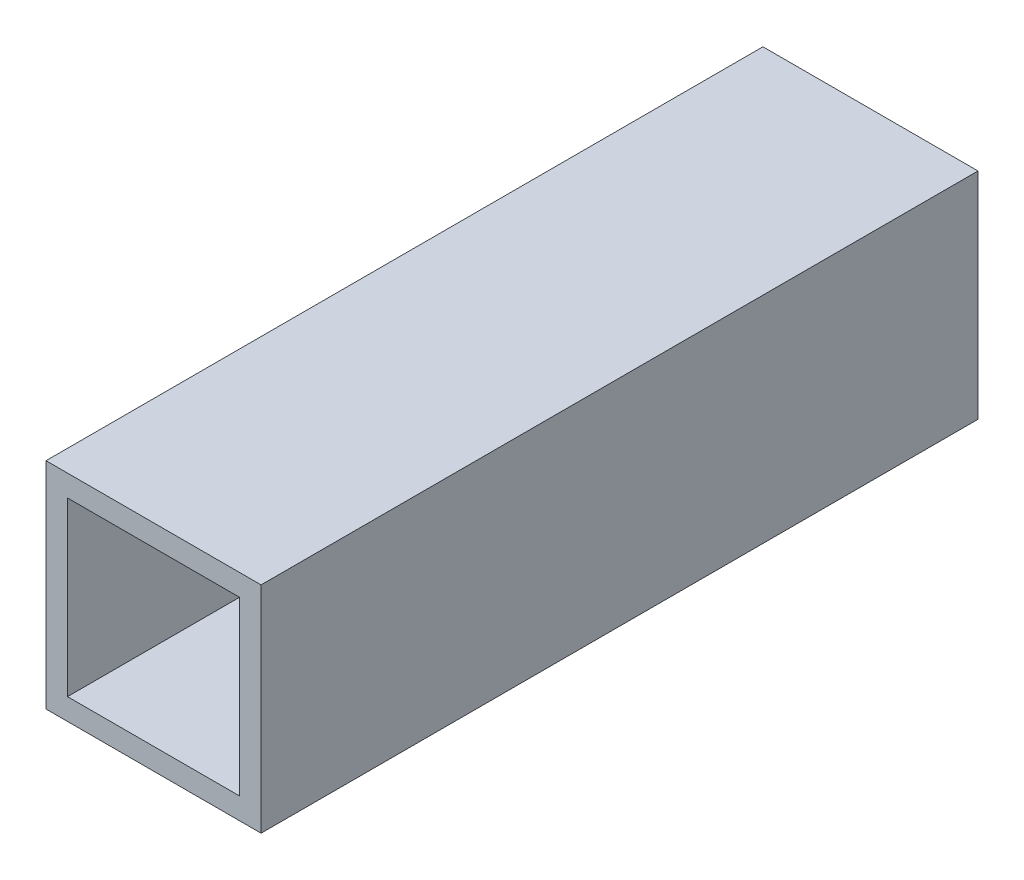
ISO-10303-21;
HEADER;
FILE_DESCRIPTION(('STEP AP214'),'2;1');
FILE_NAME('part.step','',(''),(''),'','','');
FILE_SCHEMA(('AUTOMOTIVE_DESIGN { 1 0 10303 214 1 1 1 1 }'));
ENDSEC;
DATA;
#1=APPLICATION_CONTEXT('core data for automotive mechanical design processes');
#2=APPLICATION_PROTOCOL_DEFINITION('international standard','automotive_design',2000,#1);
#3=PRODUCT_CONTEXT('',#1,'mechanical');
#4=PRODUCT('Part','Part','',(#3));
#5=PRODUCT_RELATED_PRODUCT_CATEGORY('part','',(#4));
#6=PRODUCT_DEFINITION_FORMATION('','',#4);
#7=PRODUCT_DEFINITION_CONTEXT('part definition',#1,'design');
#8=PRODUCT_DEFINITION('design','',#6,#7);
#9=PRODUCT_DEFINITION_SHAPE('','',#8);
#10=(LENGTH_UNIT() NAMED_UNIT(*) SI_UNIT(.MILLI.,.METRE.));
#11=(NAMED_UNIT(*) PLANE_ANGLE_UNIT() SI_UNIT($,.RADIAN.));
#12=(NAMED_UNIT(*) SI_UNIT($,.STERADIAN.) SOLID_ANGLE_UNIT());
#13=UNCERTAINTY_MEASURE_WITH_UNIT(LENGTH_MEASURE(1.E-05),#10,'distance_accuracy_value','');
#14=(GEOMETRIC_REPRESENTATION_CONTEXT(3) GLOBAL_UNCERTAINTY_ASSIGNED_CONTEXT((#13)) GLOBAL_UNIT_ASSIGNED_CONTEXT((#10,
#11,#12)) REPRESENTATION_CONTEXT('',''));
#15=CARTESIAN_POINT('',(0.,0.,0.));
#16=DIRECTION('',(0.,0.,1.));
#17=DIRECTION('',(1.,0.,0.));
#18=AXIS2_PLACEMENT_3D('',#15,#16,#17);
#19=CARTESIAN_POINT('',(0.,0.,50.));
#20=DIRECTION('',(0.,0.,1.));
#21=DIRECTION('',(1.,0.,0.));
#22=AXIS2_PLACEMENT_3D('',#19,#20,#21);
#23=PLANE('',#22);
#24=DIRECTION('',(0.,-1.,0.));
#25=VECTOR('',#24,1.);
#26=CARTESIAN_POINT('',(-7.01008414074451,7.73262608579252,50.));
#27=LINE('',#26,#25);
#28=CARTESIAN_POINT('',(-7.01008414074451,7.73262608579252,50.));
#29=VERTEX_POINT('',#28);
#30=CARTESIAN_POINT('',(-7.01008414074451,-7.26737391420748,50.));
#31=VERTEX_POINT('',#30);
#32=EDGE_CURVE('E133',#29,#31,#27,.T.);
#33=ORIENTED_EDGE('',*,*,#32,.T.);
#34=DIRECTION('',(1.,0.,0.));
#35=VECTOR('',#34,1.);
#36=CARTESIAN_POINT('',(-7.01008414074451,-7.26737391420748,50.));
#37=LINE('',#36,#35);
#38=CARTESIAN_POINT('',(7.98991585925548,-7.26737391420748,50.));
#39=VERTEX_POINT('',#38);
#40=EDGE_CURVE('E136',#31,#39,#37,.T.);
#41=ORIENTED_EDGE('',*,*,#40,.T.);
#42=DIRECTION('',(0.,1.,0.));
#43=VECTOR('',#42,1.);
#44=CARTESIAN_POINT('',(7.98991585925549,7.73262608579252,50.));
#45=LINE('',#44,#43);
#46=CARTESIAN_POINT('',(7.98991585925549,7.73262608579252,50.));
#47=VERTEX_POINT('',#46);
#48=EDGE_CURVE('E139',#39,#47,#45,.T.);
#49=ORIENTED_EDGE('',*,*,#48,.T.);
#50=DIRECTION('',(-1.,0.,0.));
#51=VECTOR('',#50,1.);
#52=CARTESIAN_POINT('',(-7.01008414074451,7.73262608579252,50.));
#53=LINE('',#52,#51);
#54=EDGE_CURVE('E141',#47,#29,#53,.T.);
#55=ORIENTED_EDGE('',*,*,#54,.T.);
#56=EDGE_LOOP('',(#33,#41,#49,#55));
#57=FACE_BOUND('',#56,.T.);
#58=DIRECTION('',(1.,0.,0.));
#59=VECTOR('',#58,1.);
#60=CARTESIAN_POINT('',(-5.51008414074451,-5.76737391420748,50.));
#61=LINE('',#60,#59);
#62=CARTESIAN_POINT('',(-5.51008414074451,-5.76737391420748,50.));
#63=VERTEX_POINT('',#62);
#64=CARTESIAN_POINT('',(6.48991585925549,-5.76737391420748,50.));
#65=VERTEX_POINT('',#64);
#66=EDGE_CURVE('E105',#63,#65,#61,.T.);
#67=ORIENTED_EDGE('',*,*,#66,.F.);
#68=DIRECTION('',(0.,-1.,0.));
#69=VECTOR('',#68,1.);
#70=CARTESIAN_POINT('',(-5.51008414074451,6.23262608579252,50.));
#71=LINE('',#70,#69);
#72=CARTESIAN_POINT('',(-5.51008414074451,6.23262608579252,50.));
#73=VERTEX_POINT('',#72);
#74=EDGE_CURVE('E97',#73,#63,#71,.T.);
#75=ORIENTED_EDGE('',*,*,#74,.F.);
#76=DIRECTION('',(-1.,0.,0.));
#77=VECTOR('',#76,1.);
#78=CARTESIAN_POINT('',(-5.51008414074451,6.23262608579252,50.));
#79=LINE('',#78,#77);
#80=CARTESIAN_POINT('',(6.48991585925549,6.23262608579252,50.));
#81=VERTEX_POINT('',#80);
#82=EDGE_CURVE('E119',#81,#73,#79,.T.);
#83=ORIENTED_EDGE('',*,*,#82,.F.);
#84=DIRECTION('',(0.,1.,0.));
#85=VECTOR('',#84,1.);
#86=CARTESIAN_POINT('',(6.48991585925549,6.23262608579252,50.));
#87=LINE('',#86,#85);
#88=EDGE_CURVE('E117',#65,#81,#87,.T.);
#89=ORIENTED_EDGE('',*,*,#88,.F.);
#90=EDGE_LOOP('',(#67,#75,#83,#89));
#91=FACE_BOUND('',#90,.T.);
#92=ADVANCED_FACE('F32',(#57,#91),#23,.T.);
#93=CARTESIAN_POINT('',(0.,0.,0.));
#94=DIRECTION('',(0.,0.,1.));
#95=DIRECTION('',(1.,0.,0.));
#96=AXIS2_PLACEMENT_3D('',#93,#94,#95);
#97=PLANE('',#96);
#98=DIRECTION('',(0.,-1.,0.));
#99=VECTOR('',#98,1.);
#100=CARTESIAN_POINT('',(-7.01008414074451,7.73262608579252,0.));
#101=LINE('',#100,#99);
#102=CARTESIAN_POINT('',(-7.01008414074451,7.73262608579252,0.));
#103=VERTEX_POINT('',#102);
#104=CARTESIAN_POINT('',(-7.01008414074451,-7.26737391420748,0.));
#105=VERTEX_POINT('',#104);
#106=EDGE_CURVE('E113',#103,#105,#101,.T.);
#107=ORIENTED_EDGE('',*,*,#106,.F.);
#108=DIRECTION('',(-1.,0.,0.));
#109=VECTOR('',#108,1.);
#110=CARTESIAN_POINT('',(-7.01008414074451,7.73262608579252,0.));
#111=LINE('',#110,#109);
#112=CARTESIAN_POINT('',(7.98991585925549,7.73262608579252,0.));
#113=VERTEX_POINT('',#112);
#114=EDGE_CURVE('E137',#113,#103,#111,.T.);
#115=ORIENTED_EDGE('',*,*,#114,.F.);
#116=DIRECTION('',(0.,1.,0.));
#117=VECTOR('',#116,1.);
#118=CARTESIAN_POINT('',(7.98991585925549,7.73262608579252,0.));
#119=LINE('',#118,#117);
#120=CARTESIAN_POINT('',(7.98991585925548,-7.26737391420748,0.));
#121=VERTEX_POINT('',#120);
#122=EDGE_CURVE('E148',#121,#113,#119,.T.);
#123=ORIENTED_EDGE('',*,*,#122,.F.);
#124=DIRECTION('',(1.,0.,0.));
#125=VECTOR('',#124,1.);
#126=CARTESIAN_POINT('',(-7.01008414074451,-7.26737391420748,0.));
#127=LINE('',#126,#125);
#128=EDGE_CURVE('E146',#105,#121,#127,.T.);
#129=ORIENTED_EDGE('',*,*,#128,.F.);
#130=EDGE_LOOP('',(#107,#115,#123,#129));
#131=FACE_BOUND('',#130,.T.);
#132=DIRECTION('',(0.,-1.,0.));
#133=VECTOR('',#132,1.);
#134=CARTESIAN_POINT('',(-5.51008414074451,6.23262608579252,0.));
#135=LINE('',#134,#133);
#136=CARTESIAN_POINT('',(-5.51008414074451,6.23262608579252,0.));
#137=VERTEX_POINT('',#136);
#138=CARTESIAN_POINT('',(-5.51008414074451,-5.76737391420748,0.));
#139=VERTEX_POINT('',#138);
#140=EDGE_CURVE('E55',#137,#139,#135,.T.);
#141=ORIENTED_EDGE('',*,*,#140,.T.);
#142=DIRECTION('',(1.,0.,0.));
#143=VECTOR('',#142,1.);
#144=CARTESIAN_POINT('',(-5.51008414074451,-5.76737391420748,0.));
#145=LINE('',#144,#143);
#146=CARTESIAN_POINT('',(6.48991585925549,-5.76737391420748,0.));
#147=VERTEX_POINT('',#146);
#148=EDGE_CURVE('E112',#139,#147,#145,.T.);
#149=ORIENTED_EDGE('',*,*,#148,.T.);
#150=DIRECTION('',(0.,1.,0.));
#151=VECTOR('',#150,1.);
#152=CARTESIAN_POINT('',(6.48991585925549,6.23262608579252,0.));
#153=LINE('',#152,#151);
#154=CARTESIAN_POINT('',(6.48991585925549,6.23262608579252,0.));
#155=VERTEX_POINT('',#154);
#156=EDGE_CURVE('E125',#147,#155,#153,.T.);
#157=ORIENTED_EDGE('',*,*,#156,.T.);
#158=DIRECTION('',(-1.,0.,0.));
#159=VECTOR('',#158,1.);
#160=CARTESIAN_POINT('',(-5.51008414074451,6.23262608579252,0.));
#161=LINE('',#160,#159);
#162=EDGE_CURVE('E106',#155,#137,#161,.T.);
#163=ORIENTED_EDGE('',*,*,#162,.T.);
#164=EDGE_LOOP('',(#141,#149,#157,#163));
#165=FACE_BOUND('',#164,.T.);
#166=ADVANCED_FACE('F166',(#131,#165),#97,.F.);
#167=CARTESIAN_POINT('',(-7.01008414074451,7.73262608579252,50.));
#168=DIRECTION('',(1.,0.,0.));
#169=DIRECTION('',(0.,1.,0.));
#170=AXIS2_PLACEMENT_3D('',#167,#168,#169);
#171=PLANE('',#170);
#172=ORIENTED_EDGE('',*,*,#106,.T.);
#173=DIRECTION('',(0.,0.,-1.));
#174=VECTOR('',#173,1.);
#175=CARTESIAN_POINT('',(-7.01008414074451,-7.26737391420748,50.));
#176=LINE('',#175,#174);
#177=EDGE_CURVE('E11',#31,#105,#176,.T.);
#178=ORIENTED_EDGE('',*,*,#177,.F.);
#179=ORIENTED_EDGE('',*,*,#32,.F.);
#180=DIRECTION('',(0.,0.,-1.));
#181=VECTOR('',#180,1.);
#182=CARTESIAN_POINT('',(-7.01008414074451,7.73262608579252,50.));
#183=LINE('',#182,#181);
#184=EDGE_CURVE('E143',#29,#103,#183,.T.);
#185=ORIENTED_EDGE('',*,*,#184,.T.);
#186=EDGE_LOOP('',(#172,#178,#179,#185));
#187=FACE_BOUND('',#186,.T.);
#188=ADVANCED_FACE('F34',(#187),#171,.F.);
#189=CARTESIAN_POINT('',(-7.01008414074451,-7.26737391420748,50.));
#190=DIRECTION('',(0.,1.,0.));
#191=DIRECTION('',(0.,0.,1.));
#192=AXIS2_PLACEMENT_3D('',#189,#190,#191);
#193=PLANE('',#192);
#194=ORIENTED_EDGE('',*,*,#128,.T.);
#195=DIRECTION('',(0.,0.,-1.));
#196=VECTOR('',#195,1.);
#197=CARTESIAN_POINT('',(7.98991585925548,-7.26737391420748,50.));
#198=LINE('',#197,#196);
#199=EDGE_CURVE('E40',#39,#121,#198,.T.);
#200=ORIENTED_EDGE('',*,*,#199,.F.);
#201=ORIENTED_EDGE('',*,*,#40,.F.);
#202=ORIENTED_EDGE('',*,*,#177,.T.);
#203=EDGE_LOOP('',(#194,#200,#201,#202));
#204=FACE_BOUND('',#203,.T.);
#205=ADVANCED_FACE('F176',(#204),#193,.F.);
#206=CARTESIAN_POINT('',(7.98991585925549,7.73262608579252,50.));
#207=DIRECTION('',(-1.,0.,0.));
#208=DIRECTION('',(0.,-1.,0.));
#209=AXIS2_PLACEMENT_3D('',#206,#207,#208);
#210=PLANE('',#209);
#211=ORIENTED_EDGE('',*,*,#122,.T.);
#212=DIRECTION('',(0.,0.,-1.));
#213=VECTOR('',#212,1.);
#214=CARTESIAN_POINT('',(7.98991585925549,7.73262608579252,50.));
#215=LINE('',#214,#213);
#216=EDGE_CURVE('E153',#47,#113,#215,.T.);
#217=ORIENTED_EDGE('',*,*,#216,.F.);
#218=ORIENTED_EDGE('',*,*,#48,.F.);
#219=ORIENTED_EDGE('',*,*,#199,.T.);
#220=EDGE_LOOP('',(#211,#217,#218,#219));
#221=FACE_BOUND('',#220,.T.);
#222=ADVANCED_FACE('F160',(#221),#210,.F.);
#223=CARTESIAN_POINT('',(-7.01008414074451,7.73262608579252,50.));
#224=DIRECTION('',(0.,-1.,0.));
#225=DIRECTION('',(0.,0.,-1.));
#226=AXIS2_PLACEMENT_3D('',#223,#224,#225);
#227=PLANE('',#226);
#228=ORIENTED_EDGE('',*,*,#114,.T.);
#229=ORIENTED_EDGE('',*,*,#184,.F.);
#230=ORIENTED_EDGE('',*,*,#54,.F.);
#231=ORIENTED_EDGE('',*,*,#216,.T.);
#232=EDGE_LOOP('',(#228,#229,#230,#231));
#233=FACE_BOUND('',#232,.T.);
#234=ADVANCED_FACE('F170',(#233),#227,.F.);
#235=CARTESIAN_POINT('',(-5.51008414074451,6.23262608579252,50.));
#236=DIRECTION('',(1.,0.,0.));
#237=DIRECTION('',(0.,1.,0.));
#238=AXIS2_PLACEMENT_3D('',#235,#236,#237);
#239=PLANE('',#238);
#240=ORIENTED_EDGE('',*,*,#140,.F.);
#241=DIRECTION('',(0.,0.,-1.));
#242=VECTOR('',#241,1.);
#243=CARTESIAN_POINT('',(-5.51008414074451,6.23262608579252,50.));
#244=LINE('',#243,#242);
#245=EDGE_CURVE('E101',#73,#137,#244,.T.);
#246=ORIENTED_EDGE('',*,*,#245,.F.);
#247=ORIENTED_EDGE('',*,*,#74,.T.);
#248=DIRECTION('',(0.,0.,-1.));
#249=VECTOR('',#248,1.);
#250=CARTESIAN_POINT('',(-5.51008414074451,-5.76737391420748,50.));
#251=LINE('',#250,#249);
#252=EDGE_CURVE('E100',#63,#139,#251,.T.);
#253=ORIENTED_EDGE('',*,*,#252,.T.);
#254=EDGE_LOOP('',(#240,#246,#247,#253));
#255=FACE_BOUND('',#254,.T.);
#256=ADVANCED_FACE('F99',(#255),#239,.T.);
#257=CARTESIAN_POINT('',(-5.51008414074451,-5.76737391420748,50.));
#258=DIRECTION('',(0.,1.,0.));
#259=DIRECTION('',(0.,0.,1.));
#260=AXIS2_PLACEMENT_3D('',#257,#258,#259);
#261=PLANE('',#260);
#262=ORIENTED_EDGE('',*,*,#148,.F.);
#263=ORIENTED_EDGE('',*,*,#252,.F.);
#264=ORIENTED_EDGE('',*,*,#66,.T.);
#265=DIRECTION('',(0.,0.,-1.));
#266=VECTOR('',#265,1.);
#267=CARTESIAN_POINT('',(6.48991585925549,-5.76737391420748,50.));
#268=LINE('',#267,#266);
#269=EDGE_CURVE('E114',#65,#147,#268,.T.);
#270=ORIENTED_EDGE('',*,*,#269,.T.);
#271=EDGE_LOOP('',(#262,#263,#264,#270));
#272=FACE_BOUND('',#271,.T.);
#273=ADVANCED_FACE('F109',(#272),#261,.T.);
#274=CARTESIAN_POINT('',(6.48991585925549,6.23262608579252,50.));
#275=DIRECTION('',(-1.,0.,0.));
#276=DIRECTION('',(0.,-1.,0.));
#277=AXIS2_PLACEMENT_3D('',#274,#275,#276);
#278=PLANE('',#277);
#279=ORIENTED_EDGE('',*,*,#156,.F.);
#280=ORIENTED_EDGE('',*,*,#269,.F.);
#281=ORIENTED_EDGE('',*,*,#88,.T.);
#282=DIRECTION('',(0.,0.,-1.));
#283=VECTOR('',#282,1.);
#284=CARTESIAN_POINT('',(6.48991585925549,6.23262608579252,50.));
#285=LINE('',#284,#283);
#286=EDGE_CURVE('E47',#81,#155,#285,.T.);
#287=ORIENTED_EDGE('',*,*,#286,.T.);
#288=EDGE_LOOP('',(#279,#280,#281,#287));
#289=FACE_BOUND('',#288,.T.);
#290=ADVANCED_FACE('F199',(#289),#278,.T.);
#291=CARTESIAN_POINT('',(-5.51008414074451,6.23262608579252,50.));
#292=DIRECTION('',(0.,-1.,0.));
#293=DIRECTION('',(0.,0.,-1.));
#294=AXIS2_PLACEMENT_3D('',#291,#292,#293);
#295=PLANE('',#294);
#296=ORIENTED_EDGE('',*,*,#162,.F.);
#297=ORIENTED_EDGE('',*,*,#286,.F.);
#298=ORIENTED_EDGE('',*,*,#82,.T.);
#299=ORIENTED_EDGE('',*,*,#245,.T.);
#300=EDGE_LOOP('',(#296,#297,#298,#299));
#301=FACE_BOUND('',#300,.T.);
#302=ADVANCED_FACE('F203',(#301),#295,.T.);
#303=CLOSED_SHELL('',(#92,#166,#188,#205,#222,#234,#256,#273,#290,#302));
#304=MANIFOLD_SOLID_BREP('B2',#303);
#305=ADVANCED_BREP_SHAPE_REPRESENTATION('',(#18,#304),#14);
#306=SHAPE_DEFINITION_REPRESENTATION(#9,#305);
ENDSEC;
END-ISO-10303-21;
